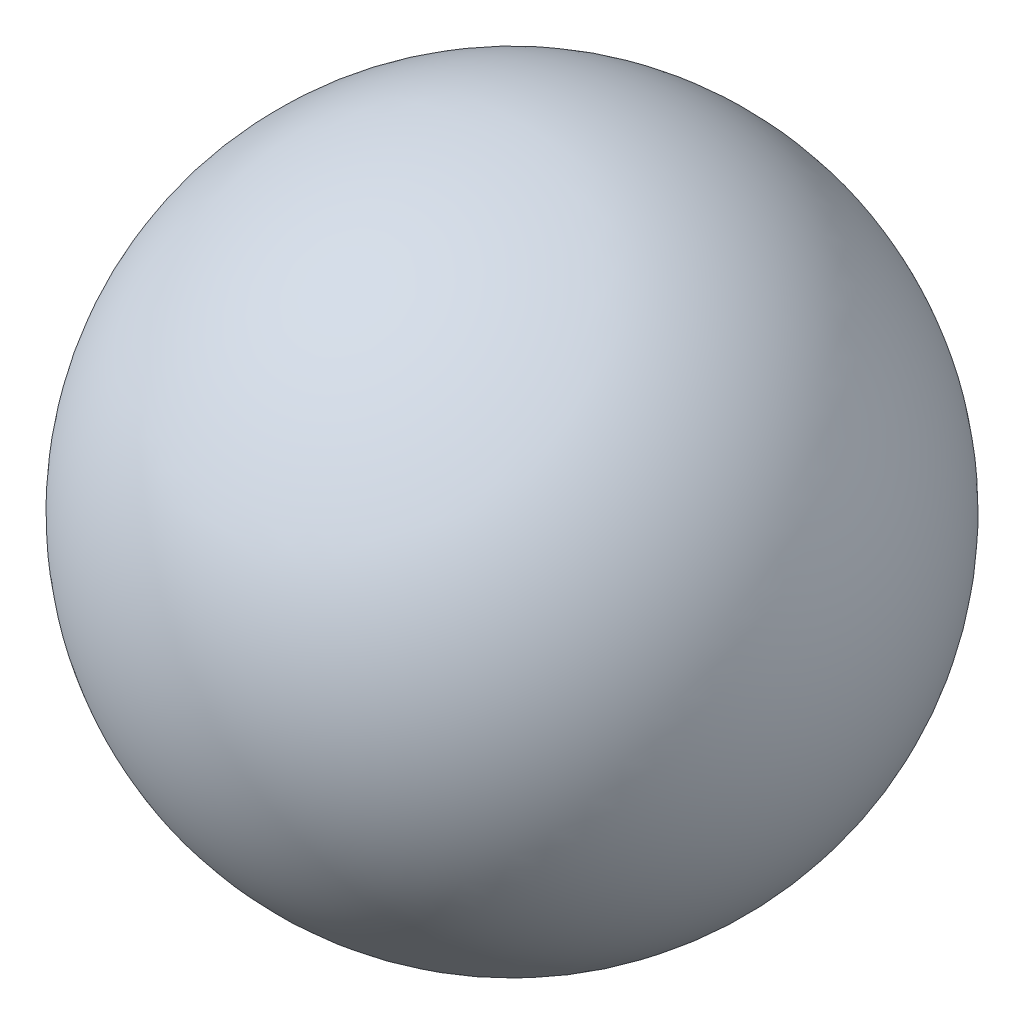
ISO-10303-21;
HEADER;
FILE_DESCRIPTION(('STEP AP214'),'2;1');
FILE_NAME('part.step','',(''),(''),'','','');
FILE_SCHEMA(('AUTOMOTIVE_DESIGN { 1 0 10303 214 1 1 1 1 }'));
ENDSEC;
DATA;
#1=APPLICATION_CONTEXT('core data for automotive mechanical design processes');
#2=APPLICATION_PROTOCOL_DEFINITION('international standard','automotive_design',2000,#1);
#3=PRODUCT_CONTEXT('',#1,'mechanical');
#4=PRODUCT('Part','Part','',(#3));
#5=PRODUCT_RELATED_PRODUCT_CATEGORY('part','',(#4));
#6=PRODUCT_DEFINITION_FORMATION('','',#4);
#7=PRODUCT_DEFINITION_CONTEXT('part definition',#1,'design');
#8=PRODUCT_DEFINITION('design','',#6,#7);
#9=PRODUCT_DEFINITION_SHAPE('','',#8);
#10=(LENGTH_UNIT() NAMED_UNIT(*) SI_UNIT(.MILLI.,.METRE.));
#11=(NAMED_UNIT(*) PLANE_ANGLE_UNIT() SI_UNIT($,.RADIAN.));
#12=(NAMED_UNIT(*) SI_UNIT($,.STERADIAN.) SOLID_ANGLE_UNIT());
#13=UNCERTAINTY_MEASURE_WITH_UNIT(LENGTH_MEASURE(1.E-05),#10,'distance_accuracy_value','');
#14=(GEOMETRIC_REPRESENTATION_CONTEXT(3) GLOBAL_UNCERTAINTY_ASSIGNED_CONTEXT((#13)) GLOBAL_UNIT_ASSIGNED_CONTEXT((#10,
#11,#12)) REPRESENTATION_CONTEXT('',''));
#15=CARTESIAN_POINT('',(0.,0.,0.));
#16=DIRECTION('',(0.,0.,1.));
#17=DIRECTION('',(1.,0.,0.));
#18=AXIS2_PLACEMENT_3D('',#15,#16,#17);
#19=CARTESIAN_POINT('',(-3.3103575428868,-2.,-11.2740424399703));
#20=DIRECTION('',(0.,0.,1.));
#21=DIRECTION('',(1.,0.,0.));
#22=AXIS2_PLACEMENT_3D('',#19,#20,#21);
#23=SPHERICAL_SURFACE('',#22,1.05);
#24=CARTESIAN_POINT('',(-3.3103575428868,-2.,-10.2240424399703));
#25=VERTEX_POINT('',#24);
#26=VERTEX_LOOP('',#25);
#27=FACE_BOUND('',#26,.T.);
#28=ADVANCED_FACE('F12',(#27),#23,.T.);
#29=CLOSED_SHELL('',(#28));
#30=MANIFOLD_SOLID_BREP('B1',#29);
#31=ADVANCED_BREP_SHAPE_REPRESENTATION('',(#18,#30),#14);
#32=SHAPE_DEFINITION_REPRESENTATION(#9,#31);
ENDSEC;
END-ISO-10303-21;
